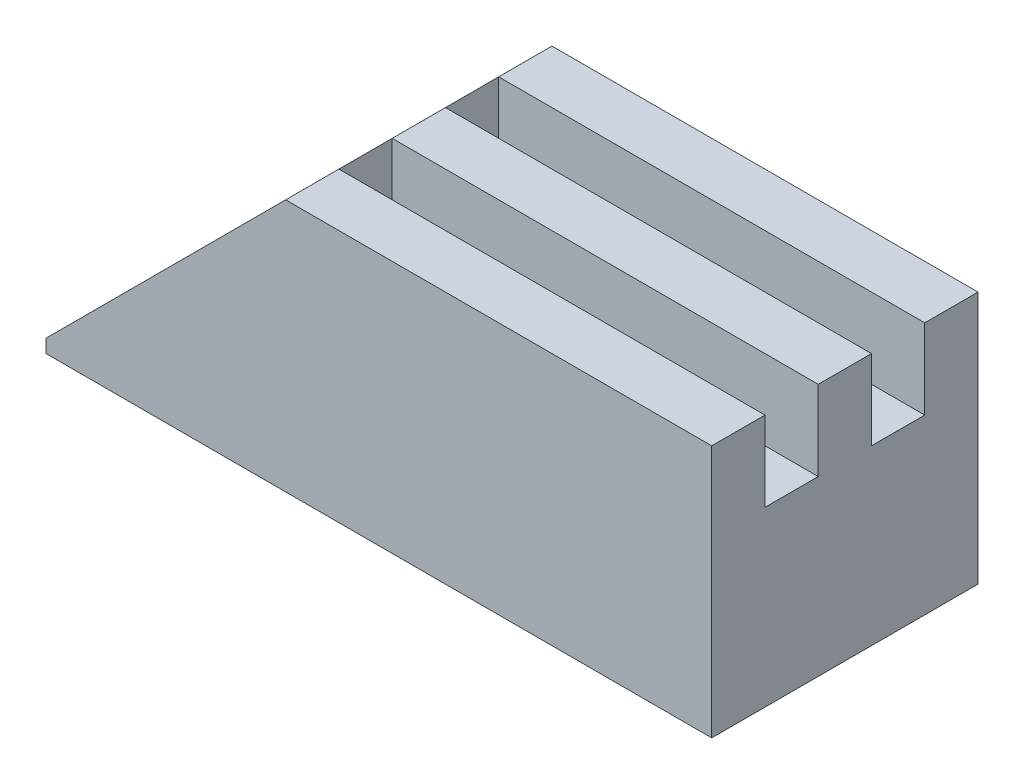
ISO-10303-21;
HEADER;
FILE_DESCRIPTION(('STEP AP214'),'2;1');
FILE_NAME('part.step','',(''),(''),'','','');
FILE_SCHEMA(('AUTOMOTIVE_DESIGN { 1 0 10303 214 1 1 1 1 }'));
ENDSEC;
DATA;
#1=APPLICATION_CONTEXT('core data for automotive mechanical design processes');
#2=APPLICATION_PROTOCOL_DEFINITION('international standard','automotive_design',2000,#1);
#3=PRODUCT_CONTEXT('',#1,'mechanical');
#4=PRODUCT('Part','Part','',(#3));
#5=PRODUCT_RELATED_PRODUCT_CATEGORY('part','',(#4));
#6=PRODUCT_DEFINITION_FORMATION('','',#4);
#7=PRODUCT_DEFINITION_CONTEXT('part definition',#1,'design');
#8=PRODUCT_DEFINITION('design','',#6,#7);
#9=PRODUCT_DEFINITION_SHAPE('','',#8);
#10=(LENGTH_UNIT() NAMED_UNIT(*) SI_UNIT(.MILLI.,.METRE.));
#11=(NAMED_UNIT(*) PLANE_ANGLE_UNIT() SI_UNIT($,.RADIAN.));
#12=(NAMED_UNIT(*) SI_UNIT($,.STERADIAN.) SOLID_ANGLE_UNIT());
#13=UNCERTAINTY_MEASURE_WITH_UNIT(LENGTH_MEASURE(1.E-05),#10,'distance_accuracy_value','');
#14=(GEOMETRIC_REPRESENTATION_CONTEXT(3) GLOBAL_UNCERTAINTY_ASSIGNED_CONTEXT((#13)) GLOBAL_UNIT_ASSIGNED_CONTEXT((#10,
#11,#12)) REPRESENTATION_CONTEXT('',''));
#15=CARTESIAN_POINT('',(0.,0.,0.));
#16=DIRECTION('',(0.,0.,1.));
#17=DIRECTION('',(1.,0.,0.));
#18=AXIS2_PLACEMENT_3D('',#15,#16,#17);
#19=CARTESIAN_POINT('',(12.5,9.5,5.));
#20=DIRECTION('',(-1.,0.,0.));
#21=DIRECTION('',(0.,0.,1.));
#22=AXIS2_PLACEMENT_3D('',#19,#20,#21);
#23=PLANE('',#22);
#24=DIRECTION('',(0.,0.,-1.));
#25=VECTOR('',#24,1.);
#26=CARTESIAN_POINT('',(12.5,6.5,0.));
#27=LINE('',#26,#25);
#28=CARTESIAN_POINT('',(12.5,6.5,-0.999999999999999));
#29=VERTEX_POINT('',#28);
#30=CARTESIAN_POINT('',(12.5,6.5,-3.));
#31=VERTEX_POINT('',#30);
#32=EDGE_CURVE('E160',#29,#31,#27,.T.);
#33=ORIENTED_EDGE('',*,*,#32,.F.);
#34=DIRECTION('',(0.,1.,0.));
#35=VECTOR('',#34,1.);
#36=CARTESIAN_POINT('',(12.5,6.5,-0.999999999999999));
#37=LINE('',#36,#35);
#38=CARTESIAN_POINT('',(12.5,9.5,-0.999999999999999));
#39=VERTEX_POINT('',#38);
#40=EDGE_CURVE('E171',#29,#39,#37,.T.);
#41=ORIENTED_EDGE('',*,*,#40,.T.);
#42=DIRECTION('',(0.,0.,-1.));
#43=VECTOR('',#42,1.);
#44=CARTESIAN_POINT('',(12.5,9.5,5.));
#45=LINE('',#44,#43);
#46=CARTESIAN_POINT('',(12.5,9.5,1.));
#47=VERTEX_POINT('',#46);
#48=EDGE_CURVE('E210',#47,#39,#45,.T.);
#49=ORIENTED_EDGE('',*,*,#48,.F.);
#50=DIRECTION('',(0.,1.,0.));
#51=VECTOR('',#50,1.);
#52=CARTESIAN_POINT('',(12.5,6.5,1.));
#53=LINE('',#52,#51);
#54=CARTESIAN_POINT('',(12.5,6.5,1.));
#55=VERTEX_POINT('',#54);
#56=EDGE_CURVE('E202',#55,#47,#53,.T.);
#57=ORIENTED_EDGE('',*,*,#56,.F.);
#58=DIRECTION('',(0.,0.,-1.));
#59=VECTOR('',#58,1.);
#60=CARTESIAN_POINT('',(12.5,6.5,0.));
#61=LINE('',#60,#59);
#62=CARTESIAN_POINT('',(12.5,6.5,3.));
#63=VERTEX_POINT('',#62);
#64=EDGE_CURVE('E182',#63,#55,#61,.T.);
#65=ORIENTED_EDGE('',*,*,#64,.F.);
#66=DIRECTION('',(0.,1.,0.));
#67=VECTOR('',#66,1.);
#68=CARTESIAN_POINT('',(12.5,6.5,3.));
#69=LINE('',#68,#67);
#70=CARTESIAN_POINT('',(12.5,9.5,3.));
#71=VERTEX_POINT('',#70);
#72=EDGE_CURVE('E190',#63,#71,#69,.T.);
#73=ORIENTED_EDGE('',*,*,#72,.T.);
#74=CARTESIAN_POINT('',(12.5,9.5,5.));
#75=VERTEX_POINT('',#74);
#76=EDGE_CURVE('E206',#75,#71,#45,.T.);
#77=ORIENTED_EDGE('',*,*,#76,.F.);
#78=DIRECTION('',(0.,-1.,0.));
#79=VECTOR('',#78,1.);
#80=CARTESIAN_POINT('',(12.5,9.5,5.));
#81=LINE('',#80,#79);
#82=CARTESIAN_POINT('',(12.5,0.,5.));
#83=VERTEX_POINT('',#82);
#84=EDGE_CURVE('E216',#75,#83,#81,.T.);
#85=ORIENTED_EDGE('',*,*,#84,.T.);
#86=DIRECTION('',(0.,0.,-1.));
#87=VECTOR('',#86,1.);
#88=CARTESIAN_POINT('',(12.5,0.,5.));
#89=LINE('',#88,#87);
#90=CARTESIAN_POINT('',(12.5,0.,-5.));
#91=VERTEX_POINT('',#90);
#92=EDGE_CURVE('E174',#83,#91,#89,.T.);
#93=ORIENTED_EDGE('',*,*,#92,.T.);
#94=DIRECTION('',(0.,-1.,0.));
#95=VECTOR('',#94,1.);
#96=CARTESIAN_POINT('',(12.5,9.5,-5.));
#97=LINE('',#96,#95);
#98=CARTESIAN_POINT('',(12.5,9.5,-5.));
#99=VERTEX_POINT('',#98);
#100=EDGE_CURVE('E233',#99,#91,#97,.T.);
#101=ORIENTED_EDGE('',*,*,#100,.F.);
#102=CARTESIAN_POINT('',(12.5,9.5,-3.));
#103=VERTEX_POINT('',#102);
#104=EDGE_CURVE('E211',#103,#99,#45,.T.);
#105=ORIENTED_EDGE('',*,*,#104,.F.);
#106=DIRECTION('',(0.,1.,0.));
#107=VECTOR('',#106,1.);
#108=CARTESIAN_POINT('',(12.5,6.5,-3.));
#109=LINE('',#108,#107);
#110=EDGE_CURVE('E158',#31,#103,#109,.T.);
#111=ORIENTED_EDGE('',*,*,#110,.F.);
#112=EDGE_LOOP('',(#33,#41,#49,#57,#65,#73,#77,#85,#93,#101,#105,#111));
#113=FACE_BOUND('',#112,.T.);
#114=ADVANCED_FACE('F33',(#113),#23,.F.);
#115=CARTESIAN_POINT('',(0.,9.5,0.));
#116=DIRECTION('',(0.,-1.,0.));
#117=DIRECTION('',(0.,0.,-1.));
#118=AXIS2_PLACEMENT_3D('',#115,#116,#117);
#119=PLANE('',#118);
#120=ORIENTED_EDGE('',*,*,#48,.T.);
#121=DIRECTION('',(1.,0.,0.));
#122=VECTOR('',#121,1.);
#123=CARTESIAN_POINT('',(0.,9.5,-0.999999999999999));
#124=LINE('',#123,#122);
#125=CARTESIAN_POINT('',(-3.49999999999999,9.5,-0.999999999999999));
#126=VERTEX_POINT('',#125);
#127=EDGE_CURVE('E169',#126,#39,#124,.T.);
#128=ORIENTED_EDGE('',*,*,#127,.F.);
#129=DIRECTION('',(0.,0.,1.));
#130=VECTOR('',#129,1.);
#131=CARTESIAN_POINT('',(-3.49999999999999,9.5,0.));
#132=LINE('',#131,#130);
#133=CARTESIAN_POINT('',(-3.49999999999999,9.5,1.));
#134=VERTEX_POINT('',#133);
#135=EDGE_CURVE('E241',#126,#134,#132,.T.);
#136=ORIENTED_EDGE('',*,*,#135,.T.);
#137=DIRECTION('',(1.,0.,0.));
#138=VECTOR('',#137,1.);
#139=CARTESIAN_POINT('',(0.,9.5,1.));
#140=LINE('',#139,#138);
#141=EDGE_CURVE('E194',#134,#47,#140,.T.);
#142=ORIENTED_EDGE('',*,*,#141,.T.);
#143=EDGE_LOOP('',(#120,#128,#136,#142));
#144=FACE_BOUND('',#143,.T.);
#145=ADVANCED_FACE('F264',(#144),#119,.F.);
#146=DIRECTION('',(-1.,0.,0.));
#147=VECTOR('',#146,1.);
#148=CARTESIAN_POINT('',(0.,9.5,3.));
#149=LINE('',#148,#147);
#150=CARTESIAN_POINT('',(-3.49999999999999,9.5,3.));
#151=VERTEX_POINT('',#150);
#152=EDGE_CURVE('E191',#71,#151,#149,.T.);
#153=ORIENTED_EDGE('',*,*,#152,.T.);
#154=CARTESIAN_POINT('',(-3.49999999999999,9.5,5.));
#155=VERTEX_POINT('',#154);
#156=EDGE_CURVE('E236',#151,#155,#132,.T.);
#157=ORIENTED_EDGE('',*,*,#156,.T.);
#158=DIRECTION('',(1.,0.,0.));
#159=VECTOR('',#158,1.);
#160=CARTESIAN_POINT('',(-12.5,9.5,5.));
#161=LINE('',#160,#159);
#162=EDGE_CURVE('E214',#155,#75,#161,.T.);
#163=ORIENTED_EDGE('',*,*,#162,.T.);
#164=ORIENTED_EDGE('',*,*,#76,.T.);
#165=EDGE_LOOP('',(#153,#157,#163,#164));
#166=FACE_BOUND('',#165,.T.);
#167=ADVANCED_FACE('F310',(#166),#119,.F.);
#168=CARTESIAN_POINT('',(-3.49999999999999,9.5,-5.));
#169=VERTEX_POINT('',#168);
#170=CARTESIAN_POINT('',(-3.49999999999999,9.5,-3.));
#171=VERTEX_POINT('',#170);
#172=EDGE_CURVE('E237',#169,#171,#132,.T.);
#173=ORIENTED_EDGE('',*,*,#172,.T.);
#174=DIRECTION('',(-1.,0.,0.));
#175=VECTOR('',#174,1.);
#176=CARTESIAN_POINT('',(0.,9.5,-3.));
#177=LINE('',#176,#175);
#178=EDGE_CURVE('E164',#103,#171,#177,.T.);
#179=ORIENTED_EDGE('',*,*,#178,.F.);
#180=ORIENTED_EDGE('',*,*,#104,.T.);
#181=DIRECTION('',(-1.,0.,0.));
#182=VECTOR('',#181,1.);
#183=CARTESIAN_POINT('',(-12.5,9.5,-5.));
#184=LINE('',#183,#182);
#185=EDGE_CURVE('E209',#99,#169,#184,.T.);
#186=ORIENTED_EDGE('',*,*,#185,.T.);
#187=EDGE_LOOP('',(#173,#179,#180,#186));
#188=FACE_BOUND('',#187,.T.);
#189=ADVANCED_FACE('F254',(#188),#119,.F.);
#190=CARTESIAN_POINT('',(-12.5,9.5,-5.));
#191=DIRECTION('',(0.,0.,1.));
#192=DIRECTION('',(1.,0.,0.));
#193=AXIS2_PLACEMENT_3D('',#190,#191,#192);
#194=PLANE('',#193);
#195=DIRECTION('',(0.,-1.,0.));
#196=VECTOR('',#195,1.);
#197=CARTESIAN_POINT('',(-12.5,9.5,-5.));
#198=LINE('',#197,#196);
#199=CARTESIAN_POINT('',(-12.5,0.499999999999961,-5.));
#200=VERTEX_POINT('',#199);
#201=CARTESIAN_POINT('',(-12.5,0.,-5.));
#202=VERTEX_POINT('',#201);
#203=EDGE_CURVE('E231',#200,#202,#198,.T.);
#204=ORIENTED_EDGE('',*,*,#203,.F.);
#205=DIRECTION('',(-0.707106781186546,-0.707106781186549,0.));
#206=VECTOR('',#205,1.);
#207=CARTESIAN_POINT('',(-3.49999999999999,9.5,-5.));
#208=LINE('',#207,#206);
#209=EDGE_CURVE('E41',#200,#169,#208,.F.);
#210=ORIENTED_EDGE('',*,*,#209,.T.);
#211=ORIENTED_EDGE('',*,*,#185,.F.);
#212=ORIENTED_EDGE('',*,*,#100,.T.);
#213=DIRECTION('',(-1.,0.,0.));
#214=VECTOR('',#213,1.);
#215=CARTESIAN_POINT('',(-12.5,0.,-5.));
#216=LINE('',#215,#214);
#217=EDGE_CURVE('E219',#91,#202,#216,.T.);
#218=ORIENTED_EDGE('',*,*,#217,.T.);
#219=EDGE_LOOP('',(#204,#210,#211,#212,#218));
#220=FACE_BOUND('',#219,.T.);
#221=ADVANCED_FACE('F248',(#220),#194,.F.);
#222=CARTESIAN_POINT('',(-12.5,9.5,5.));
#223=DIRECTION('',(1.,0.,0.));
#224=DIRECTION('',(0.,0.,-1.));
#225=AXIS2_PLACEMENT_3D('',#222,#223,#224);
#226=PLANE('',#225);
#227=DIRECTION('',(0.,-1.,0.));
#228=VECTOR('',#227,1.);
#229=CARTESIAN_POINT('',(-12.5,9.5,5.));
#230=LINE('',#229,#228);
#231=CARTESIAN_POINT('',(-12.5,0.499999999999961,5.));
#232=VERTEX_POINT('',#231);
#233=CARTESIAN_POINT('',(-12.5,0.,5.));
#234=VERTEX_POINT('',#233);
#235=EDGE_CURVE('E229',#232,#234,#230,.T.);
#236=ORIENTED_EDGE('',*,*,#235,.F.);
#237=DIRECTION('',(0.,0.,-1.));
#238=VECTOR('',#237,1.);
#239=CARTESIAN_POINT('',(-12.5,0.499999999999961,5.));
#240=LINE('',#239,#238);
#241=EDGE_CURVE('E243',#232,#200,#240,.T.);
#242=ORIENTED_EDGE('',*,*,#241,.T.);
#243=ORIENTED_EDGE('',*,*,#203,.T.);
#244=DIRECTION('',(0.,0.,1.));
#245=VECTOR('',#244,1.);
#246=CARTESIAN_POINT('',(-12.5,0.,5.));
#247=LINE('',#246,#245);
#248=EDGE_CURVE('E222',#202,#234,#247,.T.);
#249=ORIENTED_EDGE('',*,*,#248,.T.);
#250=EDGE_LOOP('',(#236,#242,#243,#249));
#251=FACE_BOUND('',#250,.T.);
#252=ADVANCED_FACE('F315',(#251),#226,.F.);
#253=CARTESIAN_POINT('',(-12.5,9.5,5.));
#254=DIRECTION('',(0.,0.,-1.));
#255=DIRECTION('',(-1.,0.,0.));
#256=AXIS2_PLACEMENT_3D('',#253,#254,#255);
#257=PLANE('',#256);
#258=ORIENTED_EDGE('',*,*,#162,.F.);
#259=DIRECTION('',(0.707106781186546,0.707106781186549,0.));
#260=VECTOR('',#259,1.);
#261=CARTESIAN_POINT('',(-3.49999999999999,9.5,5.));
#262=LINE('',#261,#260);
#263=EDGE_CURVE('E240',#155,#232,#262,.F.);
#264=ORIENTED_EDGE('',*,*,#263,.T.);
#265=ORIENTED_EDGE('',*,*,#235,.T.);
#266=DIRECTION('',(1.,0.,0.));
#267=VECTOR('',#266,1.);
#268=CARTESIAN_POINT('',(-12.5,0.,5.));
#269=LINE('',#268,#267);
#270=EDGE_CURVE('E225',#234,#83,#269,.T.);
#271=ORIENTED_EDGE('',*,*,#270,.T.);
#272=ORIENTED_EDGE('',*,*,#84,.F.);
#273=EDGE_LOOP('',(#258,#264,#265,#271,#272));
#274=FACE_BOUND('',#273,.T.);
#275=ADVANCED_FACE('F303',(#274),#257,.F.);
#276=CARTESIAN_POINT('',(0.,0.,0.));
#277=DIRECTION('',(0.,-1.,0.));
#278=DIRECTION('',(0.,0.,-1.));
#279=AXIS2_PLACEMENT_3D('',#276,#277,#278);
#280=PLANE('',#279);
#281=ORIENTED_EDGE('',*,*,#92,.F.);
#282=ORIENTED_EDGE('',*,*,#270,.F.);
#283=ORIENTED_EDGE('',*,*,#248,.F.);
#284=ORIENTED_EDGE('',*,*,#217,.F.);
#285=EDGE_LOOP('',(#281,#282,#283,#284));
#286=FACE_BOUND('',#285,.T.);
#287=ADVANCED_FACE('F295',(#286),#280,.T.);
#288=CARTESIAN_POINT('',(-3.49999999999999,9.5,0.));
#289=DIRECTION('',(0.707106781186549,-0.707106781186546,0.));
#290=DIRECTION('',(0.,0.,1.));
#291=AXIS2_PLACEMENT_3D('',#288,#289,#290);
#292=PLANE('',#291);
#293=CARTESIAN_POINT('',(-5.51525432638165,7.48474567361833,0.));
#294=DIRECTION('',(-0.707106781186549,0.707106781186546,0.));
#295=DIRECTION('',(-0.707106781186546,-0.707106781186549,0.));
#296=AXIS2_PLACEMENT_3D('',#293,#294,#295);
#297=CIRCLE('',#296,1.25);
#298=CARTESIAN_POINT('',(-6.39913780286484,6.60086219713515,0.));
#299=VERTEX_POINT('',#298);
#300=EDGE_CURVE('E280',#299,#299,#297,.T.);
#301=ORIENTED_EDGE('',*,*,#300,.F.);
#302=EDGE_LOOP('',(#301));
#303=FACE_BOUND('',#302,.T.);
#304=ORIENTED_EDGE('',*,*,#209,.F.);
#305=ORIENTED_EDGE('',*,*,#241,.F.);
#306=ORIENTED_EDGE('',*,*,#263,.F.);
#307=ORIENTED_EDGE('',*,*,#156,.F.);
#308=DIRECTION('',(0.,0.,1.));
#309=VECTOR('',#308,1.);
#310=CARTESIAN_POINT('',(-3.49999999999999,9.5,0.));
#311=LINE('',#310,#309);
#312=EDGE_CURVE('E183',#134,#151,#311,.T.);
#313=ORIENTED_EDGE('',*,*,#312,.F.);
#314=ORIENTED_EDGE('',*,*,#135,.F.);
#315=DIRECTION('',(0.,0.,1.));
#316=VECTOR('',#315,1.);
#317=CARTESIAN_POINT('',(-3.49999999999999,9.5,0.));
#318=LINE('',#317,#316);
#319=EDGE_CURVE('E166',#171,#126,#318,.T.);
#320=ORIENTED_EDGE('',*,*,#319,.F.);
#321=ORIENTED_EDGE('',*,*,#172,.F.);
#322=EDGE_LOOP('',(#304,#305,#306,#307,#313,#314,#320,#321));
#323=FACE_BOUND('',#322,.T.);
#324=ADVANCED_FACE('F35',(#303,#323),#292,.F.);
#325=CARTESIAN_POINT('',(0.,6.5,3.));
#326=DIRECTION('',(0.,0.,-1.));
#327=DIRECTION('',(-1.,0.,0.));
#328=AXIS2_PLACEMENT_3D('',#325,#326,#327);
#329=PLANE('',#328);
#330=ORIENTED_EDGE('',*,*,#152,.F.);
#331=ORIENTED_EDGE('',*,*,#72,.F.);
#332=DIRECTION('',(-1.,0.,0.));
#333=VECTOR('',#332,1.);
#334=CARTESIAN_POINT('',(0.,6.5,3.));
#335=LINE('',#334,#333);
#336=CARTESIAN_POINT('',(-3.49999999999999,6.5,3.));
#337=VERTEX_POINT('',#336);
#338=EDGE_CURVE('E179',#63,#337,#335,.T.);
#339=ORIENTED_EDGE('',*,*,#338,.T.);
#340=DIRECTION('',(0.,1.,0.));
#341=VECTOR('',#340,1.);
#342=CARTESIAN_POINT('',(-3.49999999999999,6.5,3.));
#343=LINE('',#342,#341);
#344=EDGE_CURVE('E167',#337,#151,#343,.T.);
#345=ORIENTED_EDGE('',*,*,#344,.T.);
#346=EDGE_LOOP('',(#330,#331,#339,#345));
#347=FACE_BOUND('',#346,.T.);
#348=ADVANCED_FACE('F294',(#347),#329,.T.);
#349=CARTESIAN_POINT('',(-3.49999999999999,6.5,0.));
#350=DIRECTION('',(-1.,0.,0.));
#351=DIRECTION('',(0.,0.,1.));
#352=AXIS2_PLACEMENT_3D('',#349,#350,#351);
#353=PLANE('',#352);
#354=DIRECTION('',(0.,0.,1.));
#355=VECTOR('',#354,1.);
#356=CARTESIAN_POINT('',(-3.49999999999999,6.5,0.));
#357=LINE('',#356,#355);
#358=CARTESIAN_POINT('',(-3.49999999999999,6.5,1.01564066396042));
#359=VERTEX_POINT('',#358);
#360=EDGE_CURVE('E188',#359,#337,#357,.T.);
#361=ORIENTED_EDGE('',*,*,#360,.F.);
#362=CARTESIAN_POINT('',(-3.49999999999999,5.46949134723668,0.));
#363=DIRECTION('',(-1.,0.,0.));
#364=DIRECTION('',(0.,1.,0.));
#365=AXIS2_PLACEMENT_3D('',#362,#363,#364);
#366=ELLIPSE('',#365,1.76776695296637,1.25);
#367=CARTESIAN_POINT('',(-3.49999999999999,6.5301515190165,1.));
#368=VERTEX_POINT('',#367);
#369=EDGE_CURVE('E48',#359,#368,#366,.T.);
#370=ORIENTED_EDGE('',*,*,#369,.T.);
#371=DIRECTION('',(0.,1.,0.));
#372=VECTOR('',#371,1.);
#373=CARTESIAN_POINT('',(-3.49999999999999,6.5,1.));
#374=LINE('',#373,#372);
#375=EDGE_CURVE('E200',#368,#134,#374,.T.);
#376=ORIENTED_EDGE('',*,*,#375,.T.);
#377=ORIENTED_EDGE('',*,*,#312,.T.);
#378=ORIENTED_EDGE('',*,*,#344,.F.);
#379=EDGE_LOOP('',(#361,#370,#376,#377,#378));
#380=FACE_BOUND('',#379,.T.);
#381=ADVANCED_FACE('F300',(#380),#353,.F.);
#382=CARTESIAN_POINT('',(0.,6.5,1.));
#383=DIRECTION('',(0.,0.,1.));
#384=DIRECTION('',(1.,0.,0.));
#385=AXIS2_PLACEMENT_3D('',#382,#383,#384);
#386=PLANE('',#385);
#387=DIRECTION('',(-0.707106781186549,0.707106781186546,0.));
#388=VECTOR('',#387,1.);
#389=CARTESIAN_POINT('',(-2.15649711574555,5.18664863476206,1.));
#390=LINE('',#389,#388);
#391=CARTESIAN_POINT('',(-3.46984848098349,6.5,1.));
#392=VERTEX_POINT('',#391);
#393=EDGE_CURVE('E275',#392,#368,#390,.T.);
#394=ORIENTED_EDGE('',*,*,#393,.F.);
#395=DIRECTION('',(1.,0.,0.));
#396=VECTOR('',#395,1.);
#397=CARTESIAN_POINT('',(0.,6.5,1.));
#398=LINE('',#397,#396);
#399=EDGE_CURVE('E186',#392,#55,#398,.T.);
#400=ORIENTED_EDGE('',*,*,#399,.T.);
#401=ORIENTED_EDGE('',*,*,#56,.T.);
#402=ORIENTED_EDGE('',*,*,#141,.F.);
#403=ORIENTED_EDGE('',*,*,#375,.F.);
#404=EDGE_LOOP('',(#394,#400,#401,#402,#403));
#405=FACE_BOUND('',#404,.T.);
#406=ADVANCED_FACE('F322',(#405),#386,.T.);
#407=CARTESIAN_POINT('',(0.,6.5,0.));
#408=DIRECTION('',(0.,1.,0.));
#409=DIRECTION('',(0.,0.,1.));
#410=AXIS2_PLACEMENT_3D('',#407,#408,#409);
#411=PLANE('',#410);
#412=CARTESIAN_POINT('',(-4.53050865276331,6.5,0.));
#413=DIRECTION('',(0.,1.,0.));
#414=DIRECTION('',(-1.,0.,0.));
#415=AXIS2_PLACEMENT_3D('',#412,#413,#414);
#416=ELLIPSE('',#415,1.76776695296637,1.25);
#417=EDGE_CURVE('E277',#359,#392,#416,.T.);
#418=ORIENTED_EDGE('',*,*,#417,.F.);
#419=ORIENTED_EDGE('',*,*,#360,.T.);
#420=ORIENTED_EDGE('',*,*,#338,.F.);
#421=ORIENTED_EDGE('',*,*,#64,.T.);
#422=ORIENTED_EDGE('',*,*,#399,.F.);
#423=EDGE_LOOP('',(#418,#419,#420,#421,#422));
#424=FACE_BOUND('',#423,.T.);
#425=ADVANCED_FACE('F325',(#424),#411,.T.);
#426=CARTESIAN_POINT('',(0.,6.5,-0.999999999999999));
#427=DIRECTION('',(0.,0.,1.));
#428=DIRECTION('',(1.,0.,0.));
#429=AXIS2_PLACEMENT_3D('',#426,#427,#428);
#430=PLANE('',#429);
#431=DIRECTION('',(1.,0.,0.));
#432=VECTOR('',#431,1.);
#433=CARTESIAN_POINT('',(0.,6.5,-0.999999999999999));
#434=LINE('',#433,#432);
#435=CARTESIAN_POINT('',(-3.46984848098349,6.5,-0.999999999999999));
#436=VERTEX_POINT('',#435);
#437=EDGE_CURVE('E156',#436,#29,#434,.T.);
#438=ORIENTED_EDGE('',*,*,#437,.F.);
#439=DIRECTION('',(-0.707106781186549,0.707106781186546,0.));
#440=VECTOR('',#439,1.);
#441=CARTESIAN_POINT('',(-2.15649711574555,5.18664863476206,-0.999999999999999));
#442=LINE('',#441,#440);
#443=CARTESIAN_POINT('',(-3.49999999999999,6.5301515190165,-0.999999999999999));
#444=VERTEX_POINT('',#443);
#445=EDGE_CURVE('E55',#436,#444,#442,.T.);
#446=ORIENTED_EDGE('',*,*,#445,.T.);
#447=DIRECTION('',(0.,1.,0.));
#448=VECTOR('',#447,1.);
#449=CARTESIAN_POINT('',(-3.49999999999999,6.5,-0.999999999999999));
#450=LINE('',#449,#448);
#451=EDGE_CURVE('E150',#444,#126,#450,.T.);
#452=ORIENTED_EDGE('',*,*,#451,.T.);
#453=ORIENTED_EDGE('',*,*,#127,.T.);
#454=ORIENTED_EDGE('',*,*,#40,.F.);
#455=EDGE_LOOP('',(#438,#446,#452,#453,#454));
#456=FACE_BOUND('',#455,.T.);
#457=ADVANCED_FACE('F268',(#456),#430,.F.);
#458=CARTESIAN_POINT('',(-3.49999999999999,6.5,0.));
#459=DIRECTION('',(-1.,0.,0.));
#460=DIRECTION('',(0.,0.,1.));
#461=AXIS2_PLACEMENT_3D('',#458,#459,#460);
#462=PLANE('',#461);
#463=ORIENTED_EDGE('',*,*,#451,.F.);
#464=CARTESIAN_POINT('',(-3.49999999999999,5.46949134723668,0.));
#465=DIRECTION('',(-1.,0.,0.));
#466=DIRECTION('',(0.,1.,0.));
#467=AXIS2_PLACEMENT_3D('',#464,#465,#466);
#468=ELLIPSE('',#467,1.76776695296637,1.25);
#469=CARTESIAN_POINT('',(-3.49999999999999,6.5,-1.01564066396042));
#470=VERTEX_POINT('',#469);
#471=EDGE_CURVE('E138',#444,#470,#468,.T.);
#472=ORIENTED_EDGE('',*,*,#471,.T.);
#473=DIRECTION('',(0.,0.,1.));
#474=VECTOR('',#473,1.);
#475=CARTESIAN_POINT('',(-3.49999999999999,6.5,0.));
#476=LINE('',#475,#474);
#477=CARTESIAN_POINT('',(-3.49999999999999,6.5,-3.));
#478=VERTEX_POINT('',#477);
#479=EDGE_CURVE('E147',#478,#470,#476,.T.);
#480=ORIENTED_EDGE('',*,*,#479,.F.);
#481=DIRECTION('',(0.,1.,0.));
#482=VECTOR('',#481,1.);
#483=CARTESIAN_POINT('',(-3.49999999999999,6.5,-3.));
#484=LINE('',#483,#482);
#485=EDGE_CURVE('E176',#478,#171,#484,.T.);
#486=ORIENTED_EDGE('',*,*,#485,.T.);
#487=ORIENTED_EDGE('',*,*,#319,.T.);
#488=EDGE_LOOP('',(#463,#472,#480,#486,#487));
#489=FACE_BOUND('',#488,.T.);
#490=ADVANCED_FACE('F145',(#489),#462,.F.);
#491=CARTESIAN_POINT('',(0.,6.5,-3.));
#492=DIRECTION('',(0.,0.,-1.));
#493=DIRECTION('',(-1.,0.,0.));
#494=AXIS2_PLACEMENT_3D('',#491,#492,#493);
#495=PLANE('',#494);
#496=ORIENTED_EDGE('',*,*,#178,.T.);
#497=ORIENTED_EDGE('',*,*,#485,.F.);
#498=DIRECTION('',(-1.,0.,0.));
#499=VECTOR('',#498,1.);
#500=CARTESIAN_POINT('',(0.,6.5,-3.));
#501=LINE('',#500,#499);
#502=EDGE_CURVE('E155',#31,#478,#501,.T.);
#503=ORIENTED_EDGE('',*,*,#502,.F.);
#504=ORIENTED_EDGE('',*,*,#110,.T.);
#505=EDGE_LOOP('',(#496,#497,#503,#504));
#506=FACE_BOUND('',#505,.T.);
#507=ADVANCED_FACE('F333',(#506),#495,.F.);
#508=CARTESIAN_POINT('',(0.,6.5,0.));
#509=DIRECTION('',(0.,1.,0.));
#510=DIRECTION('',(0.,0.,1.));
#511=AXIS2_PLACEMENT_3D('',#508,#509,#510);
#512=PLANE('',#511);
#513=CARTESIAN_POINT('',(-4.53050865276331,6.5,0.));
#514=DIRECTION('',(0.,1.,0.));
#515=DIRECTION('',(-1.,0.,0.));
#516=AXIS2_PLACEMENT_3D('',#513,#514,#515);
#517=ELLIPSE('',#516,1.76776695296637,1.25);
#518=EDGE_CURVE('E11',#436,#470,#517,.T.);
#519=ORIENTED_EDGE('',*,*,#518,.F.);
#520=ORIENTED_EDGE('',*,*,#437,.T.);
#521=ORIENTED_EDGE('',*,*,#32,.T.);
#522=ORIENTED_EDGE('',*,*,#502,.T.);
#523=ORIENTED_EDGE('',*,*,#479,.T.);
#524=EDGE_LOOP('',(#519,#520,#521,#522,#523));
#525=FACE_BOUND('',#524,.T.);
#526=ADVANCED_FACE('F153',(#525),#512,.T.);
#527=CARTESIAN_POINT('',(-2.68682720163546,4.65631854887215,0.));
#528=DIRECTION('',(-0.707106781186549,0.707106781186546,0.));
#529=DIRECTION('',(-0.707106781186546,-0.707106781186549,0.));
#530=AXIS2_PLACEMENT_3D('',#527,#528,#529);
#531=CYLINDRICAL_SURFACE('',#530,1.25);
#532=CARTESIAN_POINT('',(-2.68682720163546,4.65631854887215,0.));
#533=DIRECTION('',(-0.707106781186549,0.707106781186546,0.));
#534=DIRECTION('',(-0.707106781186546,-0.707106781186549,0.));
#535=AXIS2_PLACEMENT_3D('',#532,#533,#534);
#536=CIRCLE('',#535,1.25);
#537=CARTESIAN_POINT('',(-3.57071067811864,3.77243507238896,0.));
#538=VERTEX_POINT('',#537);
#539=EDGE_CURVE('E151',#538,#538,#536,.T.);
#540=ORIENTED_EDGE('',*,*,#539,.F.);
#541=EDGE_LOOP('',(#540));
#542=FACE_BOUND('',#541,.T.);
#543=ORIENTED_EDGE('',*,*,#300,.T.);
#544=EDGE_LOOP('',(#543));
#545=FACE_BOUND('',#544,.T.);
#546=ORIENTED_EDGE('',*,*,#518,.T.);
#547=ORIENTED_EDGE('',*,*,#471,.F.);
#548=ORIENTED_EDGE('',*,*,#445,.F.);
#549=EDGE_LOOP('',(#546,#547,#548));
#550=FACE_BOUND('',#549,.T.);
#551=ORIENTED_EDGE('',*,*,#417,.T.);
#552=ORIENTED_EDGE('',*,*,#393,.T.);
#553=ORIENTED_EDGE('',*,*,#369,.F.);
#554=EDGE_LOOP('',(#551,#552,#553));
#555=FACE_BOUND('',#554,.T.);
#556=ADVANCED_FACE('F137',(#542,#545,#550,#555),#531,.F.);
#557=CARTESIAN_POINT('',(-2.68682720163546,4.65631854887215,0.));
#558=DIRECTION('',(-0.707106781186549,0.707106781186546,0.));
#559=DIRECTION('',(-0.707106781186546,-0.707106781186549,0.));
#560=AXIS2_PLACEMENT_3D('',#557,#558,#559);
#561=PLANE('',#560);
#562=ORIENTED_EDGE('',*,*,#539,.T.);
#563=EDGE_LOOP('',(#562));
#564=FACE_BOUND('',#563,.T.);
#565=ADVANCED_FACE('F286',(#564),#561,.T.);
#566=CLOSED_SHELL('',(#114,#145,#167,#189,#221,#252,#275,#287,#324,#348,#381,#406,#425,#457,
#490,#507,#526,#556,#565));
#567=MANIFOLD_SOLID_BREP('B2',#566);
#568=ADVANCED_BREP_SHAPE_REPRESENTATION('',(#18,#567),#14);
#569=SHAPE_DEFINITION_REPRESENTATION(#9,#568);
ENDSEC;
END-ISO-10303-21;
